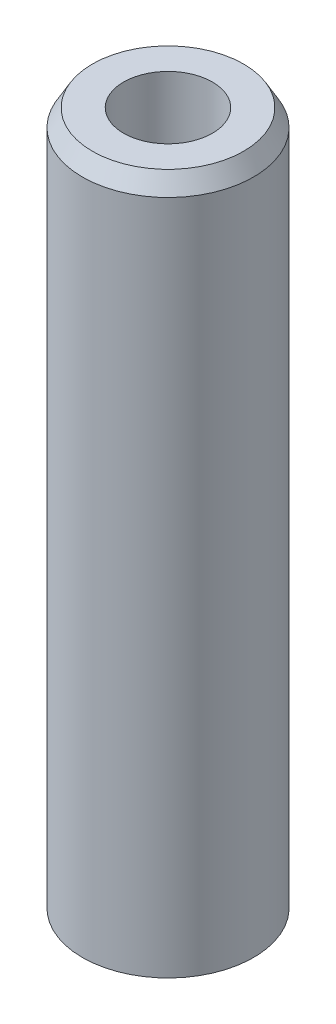
ISO-10303-21;
HEADER;
FILE_DESCRIPTION(('STEP AP214'),'2;1');
FILE_NAME('part.step','',(''),(''),'','','');
FILE_SCHEMA(('AUTOMOTIVE_DESIGN { 1 0 10303 214 1 1 1 1 }'));
ENDSEC;
DATA;
#1=APPLICATION_CONTEXT('core data for automotive mechanical design processes');
#2=APPLICATION_PROTOCOL_DEFINITION('international standard','automotive_design',2000,#1);
#3=PRODUCT_CONTEXT('',#1,'mechanical');
#4=PRODUCT('Part','Part','',(#3));
#5=PRODUCT_RELATED_PRODUCT_CATEGORY('part','',(#4));
#6=PRODUCT_DEFINITION_FORMATION('','',#4);
#7=PRODUCT_DEFINITION_CONTEXT('part definition',#1,'design');
#8=PRODUCT_DEFINITION('design','',#6,#7);
#9=PRODUCT_DEFINITION_SHAPE('','',#8);
#10=(LENGTH_UNIT() NAMED_UNIT(*) SI_UNIT(.MILLI.,.METRE.));
#11=(NAMED_UNIT(*) PLANE_ANGLE_UNIT() SI_UNIT($,.RADIAN.));
#12=(NAMED_UNIT(*) SI_UNIT($,.STERADIAN.) SOLID_ANGLE_UNIT());
#13=UNCERTAINTY_MEASURE_WITH_UNIT(LENGTH_MEASURE(1.E-05),#10,'distance_accuracy_value','');
#14=(GEOMETRIC_REPRESENTATION_CONTEXT(3) GLOBAL_UNCERTAINTY_ASSIGNED_CONTEXT((#13)) GLOBAL_UNIT_ASSIGNED_CONTEXT((#10,
#11,#12)) REPRESENTATION_CONTEXT('',''));
#15=CARTESIAN_POINT('',(0.,0.,0.));
#16=DIRECTION('',(0.,0.,1.));
#17=DIRECTION('',(1.,0.,0.));
#18=AXIS2_PLACEMENT_3D('',#15,#16,#17);
#19=CARTESIAN_POINT('',(0.,205.360323864944,0.));
#20=DIRECTION('',(0.,-1.,0.));
#21=DIRECTION('',(0.,0.,-1.));
#22=AXIS2_PLACEMENT_3D('',#19,#20,#21);
#23=CYLINDRICAL_SURFACE('',#22,25.);
#24=CARTESIAN_POINT('',(0.,200.305267102564,0.));
#25=DIRECTION('',(0.,1.,0.));
#26=DIRECTION('',(0.,0.,1.));
#27=AXIS2_PLACEMENT_3D('',#24,#25,#26);
#28=CIRCLE('',#27,25.);
#29=CARTESIAN_POINT('',(0.,200.305267102564,-25.));
#30=VERTEX_POINT('',#29);
#31=EDGE_CURVE('E50',#30,#30,#28,.F.);
#32=CARTESIAN_POINT('',(0.,2.91853838252887,0.));
#33=DIRECTION('',(0.,1.,0.));
#34=DIRECTION('',(0.,0.,1.));
#35=AXIS2_PLACEMENT_3D('',#32,#33,#34);
#36=CIRCLE('',#35,25.);
#37=CARTESIAN_POINT('',(0.,2.91853838252887,-25.));
#38=VERTEX_POINT('',#37);
#39=EDGE_CURVE('E51',#38,#38,#36,.T.);
#40=CARTESIAN_POINT('',(0.,200.305267102564,-25.));
#41=CARTESIAN_POINT('',(0.,198.249155345064,-25.));
#42=CARTESIAN_POINT('',(0.,196.193043587563,-25.));
#43=CARTESIAN_POINT('',(0.,192.080820072562,-25.));
#44=CARTESIAN_POINT('',(0.,190.024708315062,-25.));
#45=CARTESIAN_POINT('',(0.,185.912484800061,-25.));
#46=CARTESIAN_POINT('',(0.,183.856373042561,-25.));
#47=CARTESIAN_POINT('',(0.,179.74414952756,-25.));
#48=CARTESIAN_POINT('',(0.,177.68803777006,-25.));
#49=CARTESIAN_POINT('',(0.,173.575814255059,-25.));
#50=CARTESIAN_POINT('',(0.,171.519702497559,-25.));
#51=CARTESIAN_POINT('',(0.,167.407478982558,-25.));
#52=CARTESIAN_POINT('',(0.,165.351367225058,-25.));
#53=CARTESIAN_POINT('',(0.,161.239143710057,-25.));
#54=CARTESIAN_POINT('',(0.,159.183031952557,-25.));
#55=CARTESIAN_POINT('',(0.,155.070808437556,-25.));
#56=CARTESIAN_POINT('',(0.,153.014696680056,-25.));
#57=CARTESIAN_POINT('',(0.,148.902473165055,-25.));
#58=CARTESIAN_POINT('',(0.,146.846361407554,-25.));
#59=CARTESIAN_POINT('',(0.,142.734137892554,-25.));
#60=CARTESIAN_POINT('',(0.,140.678026135053,-25.));
#61=CARTESIAN_POINT('',(0.,136.565802620053,-25.));
#62=CARTESIAN_POINT('',(0.,134.509690862552,-25.));
#63=CARTESIAN_POINT('',(0.,130.397467347551,-25.));
#64=CARTESIAN_POINT('',(0.,128.341355590051,-25.));
#65=CARTESIAN_POINT('',(0.,124.22913207505,-25.));
#66=CARTESIAN_POINT('',(0.,122.17302031755,-25.));
#67=CARTESIAN_POINT('',(0.,118.060796802549,-25.));
#68=CARTESIAN_POINT('',(0.,116.004685045049,-25.));
#69=CARTESIAN_POINT('',(0.,111.892461530048,-25.));
#70=CARTESIAN_POINT('',(0.,109.836349772548,-25.));
#71=CARTESIAN_POINT('',(0.,105.724126257547,-25.));
#72=CARTESIAN_POINT('',(0.,103.668014500047,-25.));
#73=CARTESIAN_POINT('',(0.,99.555790985046,-25.));
#74=CARTESIAN_POINT('',(0.,97.4996792275457,-25.));
#75=CARTESIAN_POINT('',(0.,93.3874557125449,-25.));
#76=CARTESIAN_POINT('',(0.,91.3313439550446,-25.));
#77=CARTESIAN_POINT('',(0.,87.2191204400438,-25.));
#78=CARTESIAN_POINT('',(0.,85.1630086825435,-25.));
#79=CARTESIAN_POINT('',(0.,81.0507851675427,-25.));
#80=CARTESIAN_POINT('',(0.,78.9946734100424,-25.));
#81=CARTESIAN_POINT('',(0.,74.8824498950416,-25.));
#82=CARTESIAN_POINT('',(0.,72.8263381375413,-25.));
#83=CARTESIAN_POINT('',(0.,68.7141146225405,-25.));
#84=CARTESIAN_POINT('',(0.,66.6580028650402,-25.));
#85=CARTESIAN_POINT('',(0.,62.5457793500395,-25.));
#86=CARTESIAN_POINT('',(0.,60.4896675925391,-25.));
#87=CARTESIAN_POINT('',(0.,56.3774440775384,-25.));
#88=CARTESIAN_POINT('',(0.,54.321332320038,-25.));
#89=CARTESIAN_POINT('',(0.,50.2091088050373,-25.));
#90=CARTESIAN_POINT('',(0.,48.1529970475369,-25.));
#91=CARTESIAN_POINT('',(0.,44.0407735325362,-25.));
#92=CARTESIAN_POINT('',(0.,41.9846617750358,-25.));
#93=CARTESIAN_POINT('',(0.,37.8724382600351,-25.));
#94=CARTESIAN_POINT('',(0.,35.8163265025347,-25.));
#95=CARTESIAN_POINT('',(0.,31.704102987534,-25.));
#96=CARTESIAN_POINT('',(0.,29.6479912300336,-25.));
#97=CARTESIAN_POINT('',(0.,25.5357677150329,-25.));
#98=CARTESIAN_POINT('',(0.,23.4796559575325,-25.));
#99=CARTESIAN_POINT('',(0.,19.3674324425318,-25.));
#100=CARTESIAN_POINT('',(0.,17.3113206850314,-25.));
#101=CARTESIAN_POINT('',(0.,13.1990971700307,-25.));
#102=CARTESIAN_POINT('',(0.,11.1429854125303,-25.));
#103=CARTESIAN_POINT('',(0.,7.0307618975296,-25.));
#104=CARTESIAN_POINT('',(0.,4.97465014002924,-25.));
#105=CARTESIAN_POINT('',(0.,2.91853838252887,-25.));
#106=B_SPLINE_CURVE_WITH_KNOTS('',3,(#40,#41,#42,#43,#44,#45,#46,#47,#48,#49,#50,#51,#52,#53,
#54,#55,#56,#57,#58,#59,#60,#61,#62,#63,#64,#65,#66,#67,#68,#69,#70,#71,#72,#73,#74,#75,#76,#77,
#78,#79,#80,#81,#82,#83,#84,#85,#86,#87,#88,#89,#90,#91,#92,#93,#94,#95,#96,#97,#98,#99,#100,
#101,#102,#103,#104,#105),.UNSPECIFIED.,.F.,.F.,(4,2,2,2,2,2,2,2,2,2,2,2,2,2,2,2,2,2,2,2,2,2,2,
2,2,2,2,2,2,2,2,2,4),(0.,6.16833527250107,12.3366705450022,18.5050058175033,24.6733410900044,
30.8416763625055,37.0100116350066,43.1783469075076,49.3466821800087,55.5150174525098,
61.6833527250109,67.851687997512,74.0200232700131,80.1883585425142,86.3566938150153,
92.5250290875164,98.6933643600175,104.861699632519,111.03003490502,117.198370177521,
123.366705450022,129.535040722523,135.703375995024,141.871711267525,148.040046540026,
154.208381812527,160.376717085028,166.54505235753,172.713387630031,178.881722902532,
185.050058175033,191.218393447534,197.386728720035),.UNSPECIFIED.);
#107=EDGE_CURVE('BSEAM39',#30,#38,#106,.T.);
#108=ORIENTED_EDGE('',*,*,#31,.T.);
#109=ORIENTED_EDGE('',*,*,#39,.T.);
#110=ORIENTED_EDGE('',*,*,#107,.T.);
#111=ORIENTED_EDGE('',*,*,#107,.F.);
#112=EDGE_LOOP('',(#108,#110,#109,#111));
#113=FACE_BOUND('',#112,.T.);
#114=ADVANCED_FACE('F39',(#113),#23,.T.);
#115=CARTESIAN_POINT('',(0.,205.360323864944,0.));
#116=DIRECTION('',(0.,1.,0.));
#117=DIRECTION('',(0.,0.,1.));
#118=AXIS2_PLACEMENT_3D('',#115,#116,#117);
#119=PLANE('',#118);
#120=CARTESIAN_POINT('',(0.,205.360323864944,0.));
#121=DIRECTION('',(0.,1.,0.));
#122=DIRECTION('',(0.,0.,1.));
#123=AXIS2_PLACEMENT_3D('',#120,#121,#122);
#124=CIRCLE('',#123,22.0814616174713);
#125=CARTESIAN_POINT('',(0.,205.360323864944,22.0814616174713));
#126=VERTEX_POINT('',#125);
#127=EDGE_CURVE('E54',#126,#126,#124,.T.);
#128=ORIENTED_EDGE('',*,*,#127,.T.);
#129=EDGE_LOOP('',(#128));
#130=FACE_BOUND('',#129,.T.);
#131=CARTESIAN_POINT('',(0.,205.360323864944,0.));
#132=DIRECTION('',(0.,1.,0.));
#133=DIRECTION('',(0.,0.,1.));
#134=AXIS2_PLACEMENT_3D('',#131,#132,#133);
#135=CIRCLE('',#134,12.9684178353682);
#136=CARTESIAN_POINT('',(0.,205.360323864944,-12.9684178353682));
#137=VERTEX_POINT('',#136);
#138=EDGE_CURVE('E58',#137,#137,#135,.T.);
#139=ORIENTED_EDGE('',*,*,#138,.F.);
#140=EDGE_LOOP('',(#139));
#141=FACE_BOUND('',#140,.T.);
#142=ADVANCED_FACE('F69',(#130,#141),#119,.T.);
#143=CARTESIAN_POINT('',(0.,0.,0.));
#144=DIRECTION('',(0.,1.,0.));
#145=DIRECTION('',(0.,0.,1.));
#146=AXIS2_PLACEMENT_3D('',#143,#144,#145);
#147=PLANE('',#146);
#148=CARTESIAN_POINT('',(0.,0.,0.));
#149=DIRECTION('',(0.,1.,0.));
#150=DIRECTION('',(0.,0.,1.));
#151=AXIS2_PLACEMENT_3D('',#148,#149,#150);
#152=CIRCLE('',#151,19.9449432376201);
#153=CARTESIAN_POINT('',(0.,0.,19.9449432376201));
#154=VERTEX_POINT('',#153);
#155=EDGE_CURVE('E10',#154,#154,#152,.F.);
#156=ORIENTED_EDGE('',*,*,#155,.T.);
#157=EDGE_LOOP('',(#156));
#158=FACE_BOUND('',#157,.T.);
#159=CARTESIAN_POINT('',(0.,0.,0.));
#160=DIRECTION('',(0.,1.,0.));
#161=DIRECTION('',(0.,0.,1.));
#162=AXIS2_PLACEMENT_3D('',#159,#160,#161);
#163=CIRCLE('',#162,12.9684178353682);
#164=CARTESIAN_POINT('',(0.,0.,-12.9684178353682));
#165=VERTEX_POINT('',#164);
#166=EDGE_CURVE('E63',#165,#165,#163,.T.);
#167=ORIENTED_EDGE('',*,*,#166,.T.);
#168=EDGE_LOOP('',(#167));
#169=FACE_BOUND('',#168,.T.);
#170=ADVANCED_FACE('F75',(#158,#169),#147,.F.);
#171=CARTESIAN_POINT('',(0.,205.360323864944,0.));
#172=DIRECTION('',(0.,-1.,0.));
#173=DIRECTION('',(0.,0.,-1.));
#174=AXIS2_PLACEMENT_3D('',#171,#172,#173);
#175=CYLINDRICAL_SURFACE('',#174,12.9684178353682);
#176=CARTESIAN_POINT('',(0.,205.360323864944,-12.9684178353682));
#177=CARTESIAN_POINT('',(0.,203.221153824684,-12.9684178353682));
#178=CARTESIAN_POINT('',(0.,201.081983784424,-12.9684178353682));
#179=CARTESIAN_POINT('',(0.,196.803643703904,-12.9684178353682));
#180=CARTESIAN_POINT('',(0.,194.664473663644,-12.9684178353682));
#181=CARTESIAN_POINT('',(0.,190.386133583125,-12.9684178353682));
#182=CARTESIAN_POINT('',(0.,188.246963542865,-12.9684178353682));
#183=CARTESIAN_POINT('',(0.,183.968623462345,-12.9684178353682));
#184=CARTESIAN_POINT('',(0.,181.829453422085,-12.9684178353682));
#185=CARTESIAN_POINT('',(0.,177.551113341566,-12.9684178353682));
#186=CARTESIAN_POINT('',(0.,175.411943301306,-12.9684178353682));
#187=CARTESIAN_POINT('',(0.,171.133603220786,-12.9684178353682));
#188=CARTESIAN_POINT('',(0.,168.994433180526,-12.9684178353682));
#189=CARTESIAN_POINT('',(0.,164.716093100007,-12.9684178353682));
#190=CARTESIAN_POINT('',(0.,162.576923059747,-12.9684178353682));
#191=CARTESIAN_POINT('',(0.,158.298582979227,-12.9684178353682));
#192=CARTESIAN_POINT('',(0.,156.159412938968,-12.9684178353682));
#193=CARTESIAN_POINT('',(0.,151.881072858448,-12.9684178353682));
#194=CARTESIAN_POINT('',(0.,149.741902818188,-12.9684178353682));
#195=CARTESIAN_POINT('',(0.,145.463562737668,-12.9684178353682));
#196=CARTESIAN_POINT('',(0.,143.324392697409,-12.9684178353682));
#197=CARTESIAN_POINT('',(0.,139.046052616889,-12.9684178353682));
#198=CARTESIAN_POINT('',(0.,136.906882576629,-12.9684178353682));
#199=CARTESIAN_POINT('',(0.,132.628542496109,-12.9684178353682));
#200=CARTESIAN_POINT('',(0.,130.48937245585,-12.9684178353682));
#201=CARTESIAN_POINT('',(0.,126.21103237533,-12.9684178353682));
#202=CARTESIAN_POINT('',(0.,124.07186233507,-12.9684178353682));
#203=CARTESIAN_POINT('',(0.,119.79352225455,-12.9684178353682));
#204=CARTESIAN_POINT('',(0.,117.654352214291,-12.9684178353682));
#205=CARTESIAN_POINT('',(0.,113.376012133771,-12.9684178353682));
#206=CARTESIAN_POINT('',(0.,111.236842093511,-12.9684178353682));
#207=CARTESIAN_POINT('',(0.,106.958502012991,-12.9684178353682));
#208=CARTESIAN_POINT('',(0.,104.819331972732,-12.9684178353682));
#209=CARTESIAN_POINT('',(0.,100.540991892212,-12.9684178353682));
#210=CARTESIAN_POINT('',(0.,98.4018218519521,-12.9684178353682));
#211=CARTESIAN_POINT('',(0.,94.1234817714325,-12.9684178353682));
#212=CARTESIAN_POINT('',(0.,91.9843117311727,-12.9684178353682));
#213=CARTESIAN_POINT('',(0.,87.705971650653,-12.9684178353682));
#214=CARTESIAN_POINT('',(0.,85.5668016103932,-12.9684178353682));
#215=CARTESIAN_POINT('',(0.,81.2884615298735,-12.9684178353682));
#216=CARTESIAN_POINT('',(0.,79.1492914896137,-12.9684178353682));
#217=CARTESIAN_POINT('',(0.,74.870951409094,-12.9684178353682));
#218=CARTESIAN_POINT('',(0.,72.7317813688342,-12.9684178353682));
#219=CARTESIAN_POINT('',(0.,68.4534412883145,-12.9684178353682));
#220=CARTESIAN_POINT('',(0.,66.3142712480547,-12.9684178353682));
#221=CARTESIAN_POINT('',(0.,62.0359311675351,-12.9684178353682));
#222=CARTESIAN_POINT('',(0.,59.8967611272752,-12.9684178353682));
#223=CARTESIAN_POINT('',(0.,55.6184210467556,-12.9684178353682));
#224=CARTESIAN_POINT('',(0.,53.4792510064957,-12.9684178353682));
#225=CARTESIAN_POINT('',(0.,49.2009109259761,-12.9684178353682));
#226=CARTESIAN_POINT('',(0.,47.0617408857162,-12.9684178353682));
#227=CARTESIAN_POINT('',(0.,42.7834008051966,-12.9684178353682));
#228=CARTESIAN_POINT('',(0.,40.6442307649368,-12.9684178353682));
#229=CARTESIAN_POINT('',(0.,36.3658906844171,-12.9684178353682));
#230=CARTESIAN_POINT('',(0.,34.2267206441573,-12.9684178353682));
#231=CARTESIAN_POINT('',(0.,29.9483805636376,-12.9684178353682));
#232=CARTESIAN_POINT('',(0.,27.8092105233778,-12.9684178353682));
#233=CARTESIAN_POINT('',(0.,23.5308704428581,-12.9684178353682));
#234=CARTESIAN_POINT('',(0.,21.3917004025983,-12.9684178353682));
#235=CARTESIAN_POINT('',(0.,17.1133603220786,-12.9684178353682));
#236=CARTESIAN_POINT('',(0.,14.9741902818188,-12.9684178353682));
#237=CARTESIAN_POINT('',(0.,10.6958502012991,-12.9684178353682));
#238=CARTESIAN_POINT('',(0.,8.55668016103931,-12.9684178353682));
#239=CARTESIAN_POINT('',(0.,4.27834008051966,-12.9684178353682));
#240=CARTESIAN_POINT('',(0.,2.13917004025983,-12.9684178353682));
#241=CARTESIAN_POINT('',(0.,0.,-12.9684178353682));
#242=B_SPLINE_CURVE_WITH_KNOTS('',3,(#176,#177,#178,#179,#180,#181,#182,#183,#184,#185,#186,
#187,#188,#189,#190,#191,#192,#193,#194,#195,#196,#197,#198,#199,#200,#201,#202,#203,#204,#205,
#206,#207,#208,#209,#210,#211,#212,#213,#214,#215,#216,#217,#218,#219,#220,#221,#222,#223,#224,
#225,#226,#227,#228,#229,#230,#231,#232,#233,#234,#235,#236,#237,#238,#239,#240,#241),
.UNSPECIFIED.,.F.,.F.,(4,2,2,2,2,2,2,2,2,2,2,2,2,2,2,2,2,2,2,2,2,2,2,2,2,2,2,2,2,2,2,2,4),(0.,
6.41751012077951,12.835020241559,19.2525303623385,25.670040483118,32.0875506038975,
38.5050607246769,44.9225708454564,51.3400809662359,57.7575910870154,64.1751012077949,
70.5926113285744,77.0101214493538,83.4276315701333,89.8451416909128,96.2626518116923,
102.680161932472,109.097672053251,115.515182174031,121.93269229481,128.35020241559,
134.767712536369,141.185222657149,147.602732777928,154.020242898708,160.437753019487,
166.855263140267,173.272773261046,179.690283381826,186.107793502605,192.525303623385,
198.942813744164,205.360323864944),.UNSPECIFIED.);
#243=EDGE_CURVE('BSEAM70',#137,#165,#242,.T.);
#244=ORIENTED_EDGE('',*,*,#138,.T.);
#245=ORIENTED_EDGE('',*,*,#166,.F.);
#246=ORIENTED_EDGE('',*,*,#243,.T.);
#247=ORIENTED_EDGE('',*,*,#243,.F.);
#248=EDGE_LOOP('',(#244,#246,#245,#247));
#249=FACE_BOUND('',#248,.T.);
#250=ADVANCED_FACE('F70',(#249),#175,.F.);
#251=CARTESIAN_POINT('',(0.,205.360323864944,0.));
#252=DIRECTION('',(0.,-1.,0.));
#253=DIRECTION('',(0.,0.,-1.));
#254=AXIS2_PLACEMENT_3D('',#251,#252,#253);
#255=CONICAL_SURFACE('',#254,22.0814616174713,0.523598775598295);
#256=ORIENTED_EDGE('',*,*,#31,.F.);
#257=EDGE_LOOP('',(#256));
#258=FACE_BOUND('',#257,.T.);
#259=ORIENTED_EDGE('',*,*,#127,.F.);
#260=EDGE_LOOP('',(#259));
#261=FACE_BOUND('',#260,.T.);
#262=ADVANCED_FACE('F81',(#258,#261),#255,.T.);
#263=CARTESIAN_POINT('',(0.,2.91853838252887,0.));
#264=DIRECTION('',(0.,1.,0.));
#265=DIRECTION('',(0.,0.,1.));
#266=AXIS2_PLACEMENT_3D('',#263,#264,#265);
#267=CONICAL_SURFACE('',#266,25.,1.0471975511966);
#268=ORIENTED_EDGE('',*,*,#155,.F.);
#269=EDGE_LOOP('',(#268));
#270=FACE_BOUND('',#269,.T.);
#271=ORIENTED_EDGE('',*,*,#39,.F.);
#272=EDGE_LOOP('',(#271));
#273=FACE_BOUND('',#272,.T.);
#274=ADVANCED_FACE('F45',(#270,#273),#267,.T.);
#275=CLOSED_SHELL('',(#114,#142,#170,#250,#262,#274));
#276=MANIFOLD_SOLID_BREP('B2',#275);
#277=ADVANCED_BREP_SHAPE_REPRESENTATION('',(#18,#276),#14);
#278=SHAPE_DEFINITION_REPRESENTATION(#9,#277);
ENDSEC;
END-ISO-10303-21;
